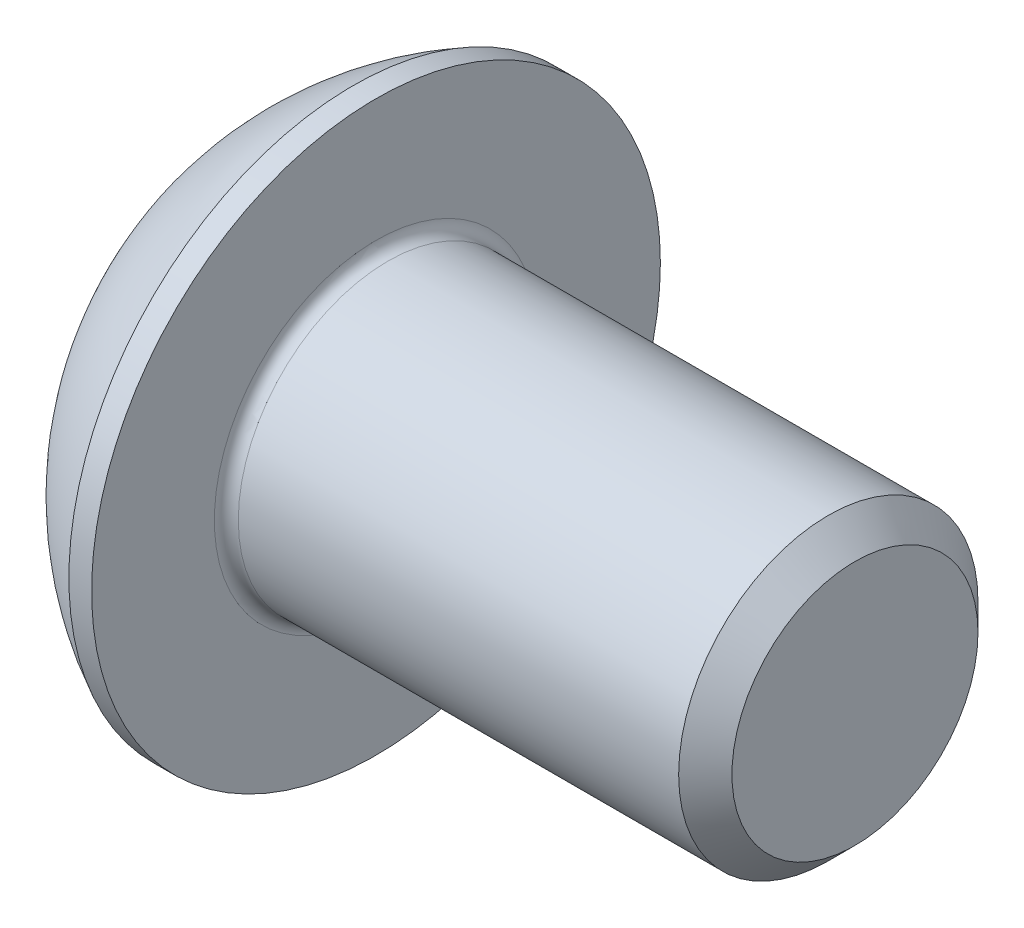
ISO-10303-21;
HEADER;
FILE_DESCRIPTION(('STEP AP214'),'2;1');
FILE_NAME('part.step','',(''),(''),'','','');
FILE_SCHEMA(('AUTOMOTIVE_DESIGN { 1 0 10303 214 1 1 1 1 }'));
ENDSEC;
DATA;
#1=APPLICATION_CONTEXT('core data for automotive mechanical design processes');
#2=APPLICATION_PROTOCOL_DEFINITION('international standard','automotive_design',2000,#1);
#3=PRODUCT_CONTEXT('',#1,'mechanical');
#4=PRODUCT('Part','Part','',(#3));
#5=PRODUCT_RELATED_PRODUCT_CATEGORY('part','',(#4));
#6=PRODUCT_DEFINITION_FORMATION('','',#4);
#7=PRODUCT_DEFINITION_CONTEXT('part definition',#1,'design');
#8=PRODUCT_DEFINITION('design','',#6,#7);
#9=PRODUCT_DEFINITION_SHAPE('','',#8);
#10=(LENGTH_UNIT() NAMED_UNIT(*) SI_UNIT(.MILLI.,.METRE.));
#11=(NAMED_UNIT(*) PLANE_ANGLE_UNIT() SI_UNIT($,.RADIAN.));
#12=(NAMED_UNIT(*) SI_UNIT($,.STERADIAN.) SOLID_ANGLE_UNIT());
#13=UNCERTAINTY_MEASURE_WITH_UNIT(LENGTH_MEASURE(1.E-05),#10,'distance_accuracy_value','');
#14=(GEOMETRIC_REPRESENTATION_CONTEXT(3) GLOBAL_UNCERTAINTY_ASSIGNED_CONTEXT((#13)) GLOBAL_UNIT_ASSIGNED_CONTEXT((#10,
#11,#12)) REPRESENTATION_CONTEXT('',''));
#15=CARTESIAN_POINT('',(0.,0.,0.));
#16=DIRECTION('',(0.,0.,1.));
#17=DIRECTION('',(1.,0.,0.));
#18=AXIS2_PLACEMENT_3D('',#15,#16,#17);
#19=CARTESIAN_POINT('',(4.75485015536775,1.66533453693773E-13,0.));
#20=DIRECTION('',(1.00000000000004,0.,0.));
#21=DIRECTION('',(0.,1.00000000000005,0.));
#22=AXIS2_PLACEMENT_3D('',#19,#20,#21);
#23=SPHERICAL_SURFACE('',#22,5.315);
#24=CARTESIAN_POINT('',(0.,0.,0.));
#25=DIRECTION('',(1.00000000000004,0.,0.));
#26=DIRECTION('',(0.,0.,-0.999999999999988));
#27=AXIS2_PLACEMENT_3D('',#24,#25,#26);
#28=CIRCLE('',#27,2.375);
#29=CARTESIAN_POINT('',(0.,0.,-2.37499999999997));
#30=VERTEX_POINT('',#29);
#31=EDGE_CURVE('E192',#30,#30,#28,.T.);
#32=ORIENTED_EDGE('',*,*,#31,.T.);
#33=EDGE_LOOP('',(#32));
#34=FACE_BOUND('',#33,.T.);
#35=CARTESIAN_POINT('',(2.37016464151057,8.04911692853238E-13,2.9247437804969E-12));
#36=DIRECTION('',(1.00000000000004,0.,0.));
#37=DIRECTION('',(0.,0.,-0.999999999999988));
#38=AXIS2_PLACEMENT_3D('',#35,#36,#37);
#39=CIRCLE('',#38,4.75);
#40=CARTESIAN_POINT('',(2.37016464151058,8.29697421877995E-13,-4.74999999999702));
#41=VERTEX_POINT('',#40);
#42=EDGE_CURVE('E179',#41,#41,#39,.T.);
#43=ORIENTED_EDGE('',*,*,#42,.F.);
#44=EDGE_LOOP('',(#43));
#45=FACE_BOUND('',#44,.T.);
#46=ADVANCED_FACE('F36',(#34,#45),#23,.T.);
#47=CARTESIAN_POINT('',(3.85108611666851E-13,2.37500000000013,5.27355936696949E-13));
#48=DIRECTION('',(-1.00000000000004,0.,0.));
#49=DIRECTION('',(0.,0.,0.999999999999988));
#50=AXIS2_PLACEMENT_3D('',#47,#48,#49);
#51=PLANE('',#50);
#52=DIRECTION('',(0.,0.500000000000031,-0.866025403784429));
#53=VECTOR('',#52,1.);
#54=CARTESIAN_POINT('',(4.9960036108132E-13,0.866025403783777,1.50000000000042));
#55=LINE('',#54,#53);
#56=CARTESIAN_POINT('',(4.9960036108132E-13,0.866025403783777,1.50000000000042));
#57=VERTEX_POINT('',#56);
#58=CARTESIAN_POINT('',(3.38618022510673E-12,1.73205080756881,3.78169717762944E-13));
#59=VERTEX_POINT('',#58);
#60=EDGE_CURVE('E158',#57,#59,#55,.T.);
#61=ORIENTED_EDGE('',*,*,#60,.F.);
#62=DIRECTION('',(0.,1.00000000000005,0.));
#63=VECTOR('',#62,1.);
#64=CARTESIAN_POINT('',(0.,-0.866025403784665,1.50000000000023));
#65=LINE('',#64,#63);
#66=CARTESIAN_POINT('',(0.,-0.866025403784665,1.50000000000023));
#67=VERTEX_POINT('',#66);
#68=EDGE_CURVE('E155',#67,#57,#65,.T.);
#69=ORIENTED_EDGE('',*,*,#68,.F.);
#70=DIRECTION('',(0.,0.500000000000023,0.866025403784426));
#71=VECTOR('',#70,1.);
#72=CARTESIAN_POINT('',(1.07552855510562E-13,-1.73205080756892,0.));
#73=LINE('',#72,#71);
#74=CARTESIAN_POINT('',(1.07552855510562E-13,-1.73205080756892,0.));
#75=VERTEX_POINT('',#74);
#76=EDGE_CURVE('E153',#75,#67,#73,.T.);
#77=ORIENTED_EDGE('',*,*,#76,.F.);
#78=DIRECTION('',(0.,-0.500000000000031,0.866025403784428));
#79=VECTOR('',#78,1.);
#80=CARTESIAN_POINT('',(0.,-0.866025403784762,-1.49999999999993));
#81=LINE('',#80,#79);
#82=CARTESIAN_POINT('',(0.,-0.866025403784762,-1.49999999999993));
#83=VERTEX_POINT('',#82);
#84=EDGE_CURVE('E151',#83,#75,#81,.T.);
#85=ORIENTED_EDGE('',*,*,#84,.F.);
#86=DIRECTION('',(0.,-1.00000000000005,0.));
#87=VECTOR('',#86,1.);
#88=CARTESIAN_POINT('',(2.22044604925031E-12,0.866025403783853,-1.49999999999973));
#89=LINE('',#88,#87);
#90=CARTESIAN_POINT('',(2.22044604925031E-12,0.866025403783853,-1.49999999999973));
#91=VERTEX_POINT('',#90);
#92=EDGE_CURVE('E125',#91,#83,#89,.T.);
#93=ORIENTED_EDGE('',*,*,#92,.F.);
#94=DIRECTION('',(0.,-0.500000000000022,-0.866025403784425));
#95=VECTOR('',#94,1.);
#96=CARTESIAN_POINT('',(3.38618022510673E-12,1.73205080756881,3.78169717762944E-13));
#97=LINE('',#96,#95);
#98=EDGE_CURVE('E118',#59,#91,#97,.T.);
#99=ORIENTED_EDGE('',*,*,#98,.F.);
#100=EDGE_LOOP('',(#61,#69,#77,#85,#93,#99));
#101=FACE_BOUND('',#100,.T.);
#102=ORIENTED_EDGE('',*,*,#31,.F.);
#103=EDGE_LOOP('',(#102));
#104=FACE_BOUND('',#103,.T.);
#105=ADVANCED_FACE('F214',(#101,#104),#51,.T.);
#106=CARTESIAN_POINT('',(10.7500000000038,6.31439345255558E-13,3.0288271890555E-12));
#107=DIRECTION('',(1.00000000000004,0.,0.));
#108=DIRECTION('',(0.,0.,-0.999999999999988));
#109=AXIS2_PLACEMENT_3D('',#106,#107,#108);
#110=PLANE('',#109);
#111=CARTESIAN_POINT('',(10.7500000000038,6.31439345255558E-13,3.0288271890555E-12));
#112=DIRECTION('',(1.00000000000004,0.,0.));
#113=DIRECTION('',(0.,0.,-0.999999999999988));
#114=AXIS2_PLACEMENT_3D('',#111,#112,#113);
#115=CIRCLE('',#114,2.055);
#116=CARTESIAN_POINT('',(10.7500000000038,6.421624343389E-13,-2.05499999999695));
#117=VERTEX_POINT('',#116);
#118=EDGE_CURVE('E189',#117,#117,#115,.T.);
#119=ORIENTED_EDGE('',*,*,#118,.T.);
#120=EDGE_LOOP('',(#119));
#121=FACE_BOUND('',#120,.T.);
#122=ADVANCED_FACE('F219',(#121),#110,.T.);
#123=CARTESIAN_POINT('',(10.7500000000038,6.31439345255558E-13,3.0288271890555E-12));
#124=DIRECTION('',(-1.00000000000004,0.,0.));
#125=DIRECTION('',(0.,0.,0.999999999999988));
#126=AXIS2_PLACEMENT_3D('',#123,#124,#125);
#127=CONICAL_SURFACE('',#126,2.055,0.785398163397435);
#128=CARTESIAN_POINT('',(10.3050000000001,5.20417042793042E-13,2.87270207621759E-12));
#129=DIRECTION('',(1.00000000000004,0.,0.));
#130=DIRECTION('',(0.,0.,-0.999999999999988));
#131=AXIS2_PLACEMENT_3D('',#128,#129,#130);
#132=CIRCLE('',#131,2.5);
#133=CARTESIAN_POINT('',(10.3050000000001,5.33462163332388E-13,-2.4999999999971));
#134=VERTEX_POINT('',#133);
#135=EDGE_CURVE('E186',#134,#134,#132,.T.);
#136=ORIENTED_EDGE('',*,*,#135,.T.);
#137=EDGE_LOOP('',(#136));
#138=FACE_BOUND('',#137,.T.);
#139=ORIENTED_EDGE('',*,*,#118,.F.);
#140=EDGE_LOOP('',(#139));
#141=FACE_BOUND('',#140,.T.);
#142=ADVANCED_FACE('F226',(#138,#141),#127,.T.);
#143=CARTESIAN_POINT('',(-3.64348996551983,0.,5.93275428784068E-13));
#144=DIRECTION('',(1.00000000000004,0.,0.));
#145=DIRECTION('',(0.,0.,-0.999999999999988));
#146=AXIS2_PLACEMENT_3D('',#143,#144,#145);
#147=CYLINDRICAL_SURFACE('',#146,2.5);
#148=CARTESIAN_POINT('',(2.95000000000001,7.35522753814166E-13,3.62557206479152E-12));
#149=DIRECTION('',(1.00000000000004,0.,0.));
#150=DIRECTION('',(0.,0.,-0.999999999999988));
#151=AXIS2_PLACEMENT_3D('',#148,#149,#150);
#152=CIRCLE('',#151,2.5);
#153=CARTESIAN_POINT('',(2.95000000000001,7.48567874353512E-13,-2.49999999999635));
#154=VERTEX_POINT('',#153);
#155=EDGE_CURVE('E44',#154,#154,#152,.T.);
#156=ORIENTED_EDGE('',*,*,#155,.T.);
#157=EDGE_LOOP('',(#156));
#158=FACE_BOUND('',#157,.T.);
#159=ORIENTED_EDGE('',*,*,#135,.F.);
#160=EDGE_LOOP('',(#159));
#161=FACE_BOUND('',#160,.T.);
#162=ADVANCED_FACE('F197',(#158,#161),#147,.T.);
#163=CARTESIAN_POINT('',(2.75000000000047,2.50000000000074,2.58126853225349E-12));
#164=DIRECTION('',(1.00000000000004,0.,0.));
#165=DIRECTION('',(0.,0.,-0.999999999999988));
#166=AXIS2_PLACEMENT_3D('',#163,#164,#165);
#167=PLANE('',#166);
#168=CARTESIAN_POINT('',(2.74999999999997,3.7470027081099E-13,3.25087179398053E-12));
#169=DIRECTION('',(1.00000000000004,0.,0.));
#170=DIRECTION('',(0.,0.,-0.999999999999988));
#171=AXIS2_PLACEMENT_3D('',#168,#169,#170);
#172=CIRCLE('',#171,2.7);
#173=CARTESIAN_POINT('',(2.74999999999998,3.88789000993484E-13,-2.69999999999672));
#174=VERTEX_POINT('',#173);
#175=EDGE_CURVE('E11',#174,#174,#172,.F.);
#176=ORIENTED_EDGE('',*,*,#175,.T.);
#177=EDGE_LOOP('',(#176));
#178=FACE_BOUND('',#177,.T.);
#179=CARTESIAN_POINT('',(2.74999999999997,3.7470027081099E-13,3.25087179398053E-12));
#180=DIRECTION('',(1.00000000000004,0.,0.));
#181=DIRECTION('',(0.,0.,-0.999999999999988));
#182=AXIS2_PLACEMENT_3D('',#179,#180,#181);
#183=CIRCLE('',#182,4.75);
#184=CARTESIAN_POINT('',(2.74999999999998,3.99485999835747E-13,-4.7499999999967));
#185=VERTEX_POINT('',#184);
#186=EDGE_CURVE('E183',#185,#185,#183,.T.);
#187=ORIENTED_EDGE('',*,*,#186,.T.);
#188=EDGE_LOOP('',(#187));
#189=FACE_BOUND('',#188,.T.);
#190=ADVANCED_FACE('F209',(#178,#189),#167,.T.);
#191=CARTESIAN_POINT('',(-3.64348996551983,0.,5.93275428784068E-13));
#192=DIRECTION('',(1.00000000000004,0.,0.));
#193=DIRECTION('',(0.,0.,-0.999999999999988));
#194=AXIS2_PLACEMENT_3D('',#191,#192,#193);
#195=CYLINDRICAL_SURFACE('',#194,4.75);
#196=ORIENTED_EDGE('',*,*,#42,.T.);
#197=EDGE_LOOP('',(#196));
#198=FACE_BOUND('',#197,.T.);
#199=ORIENTED_EDGE('',*,*,#186,.F.);
#200=EDGE_LOOP('',(#199));
#201=FACE_BOUND('',#200,.T.);
#202=ADVANCED_FACE('F201',(#198,#201),#195,.T.);
#203=CARTESIAN_POINT('',(2.95000000000001,7.35522753814166E-13,3.62557206479152E-12));
#204=DIRECTION('',(1.00000000000004,0.,0.));
#205=DIRECTION('',(0.,0.,-0.999999999999988));
#206=AXIS2_PLACEMENT_3D('',#203,#204,#205);
#207=TOROIDAL_SURFACE('',#206,2.7,0.2);
#208=ORIENTED_EDGE('',*,*,#175,.F.);
#209=EDGE_LOOP('',(#208));
#210=FACE_BOUND('',#209,.T.);
#211=ORIENTED_EDGE('',*,*,#155,.F.);
#212=EDGE_LOOP('',(#211));
#213=FACE_BOUND('',#212,.T.);
#214=ADVANCED_FACE('F38',(#210,#213),#207,.F.);
#215=CARTESIAN_POINT('',(1.56000000000223,0.866025403783978,-1.49999999999752));
#216=DIRECTION('',(0.,0.,-0.999999999999988));
#217=DIRECTION('',(-1.00000000000004,0.,0.));
#218=AXIS2_PLACEMENT_3D('',#215,#216,#217);
#219=PLANE('',#218);
#220=DIRECTION('',(0.,-1.00000000000005,0.));
#221=VECTOR('',#220,1.);
#222=CARTESIAN_POINT('',(1.56000000000223,0.866025403783978,-1.49999999999752));
#223=LINE('',#222,#221);
#224=CARTESIAN_POINT('',(1.56000000000223,0.866025403783978,-1.49999999999752));
#225=VERTEX_POINT('',#224);
#226=CARTESIAN_POINT('',(1.56000000000001,-3.88578058618805E-13,-1.49999999999761));
#227=VERTEX_POINT('',#226);
#228=EDGE_CURVE('E117',#225,#227,#223,.T.);
#229=ORIENTED_EDGE('',*,*,#228,.F.);
#230=DIRECTION('',(-1.00000000000004,0.,0.));
#231=VECTOR('',#230,1.);
#232=CARTESIAN_POINT('',(1.56000000000223,0.866025403783978,-1.49999999999752));
#233=LINE('',#232,#231);
#234=EDGE_CURVE('E163',#225,#91,#233,.T.);
#235=ORIENTED_EDGE('',*,*,#234,.T.);
#236=ORIENTED_EDGE('',*,*,#92,.T.);
#237=DIRECTION('',(-1.00000000000004,0.,0.));
#238=VECTOR('',#237,1.);
#239=CARTESIAN_POINT('',(1.56,-0.866025403784665,-1.499999999997));
#240=LINE('',#239,#238);
#241=CARTESIAN_POINT('',(1.56,-0.866025403784665,-1.499999999997));
#242=VERTEX_POINT('',#241);
#243=EDGE_CURVE('E122',#242,#83,#240,.T.);
#244=ORIENTED_EDGE('',*,*,#243,.F.);
#245=EDGE_CURVE('E107',#227,#242,#223,.T.);
#246=ORIENTED_EDGE('',*,*,#245,.F.);
#247=EDGE_LOOP('',(#229,#235,#236,#244,#246));
#248=FACE_BOUND('',#247,.T.);
#249=ADVANCED_FACE('F123',(#248),#219,.F.);
#250=CARTESIAN_POINT('',(1.56000000000339,1.73205080756919,2.7373936450914E-12));
#251=DIRECTION('',(0.,0.866025403784494,-0.499999999999999));
#252=DIRECTION('',(0.,0.500000000000021,0.866025403784426));
#253=AXIS2_PLACEMENT_3D('',#250,#251,#252);
#254=PLANE('',#253);
#255=DIRECTION('',(0.,-0.500000000000022,-0.866025403784425));
#256=VECTOR('',#255,1.);
#257=CARTESIAN_POINT('',(1.56000000000339,1.73205080756919,2.7373936450914E-12));
#258=LINE('',#257,#256);
#259=CARTESIAN_POINT('',(1.56000000000339,1.73205080756919,2.7373936450914E-12));
#260=VERTEX_POINT('',#259);
#261=CARTESIAN_POINT('',(1.55999999999984,1.29903810567677,-0.749999999997152));
#262=VERTEX_POINT('',#261);
#263=EDGE_CURVE('E129',#260,#262,#258,.T.);
#264=ORIENTED_EDGE('',*,*,#263,.F.);
#265=DIRECTION('',(-1.00000000000004,0.,0.));
#266=VECTOR('',#265,1.);
#267=CARTESIAN_POINT('',(1.56000000000339,1.73205080756919,2.7373936450914E-12));
#268=LINE('',#267,#266);
#269=EDGE_CURVE('E166',#260,#59,#268,.T.);
#270=ORIENTED_EDGE('',*,*,#269,.T.);
#271=ORIENTED_EDGE('',*,*,#98,.T.);
#272=ORIENTED_EDGE('',*,*,#234,.F.);
#273=EDGE_CURVE('E147',#262,#225,#258,.T.);
#274=ORIENTED_EDGE('',*,*,#273,.F.);
#275=EDGE_LOOP('',(#264,#270,#271,#272,#274));
#276=FACE_BOUND('',#275,.T.);
#277=ADVANCED_FACE('F207',(#276),#254,.F.);
#278=CARTESIAN_POINT('',(1.56000000000051,0.866025403784325,1.5000000000024));
#279=DIRECTION('',(0.,0.866025403784488,0.499999999999989));
#280=DIRECTION('',(0.,-0.500000000000031,0.866025403784429));
#281=AXIS2_PLACEMENT_3D('',#278,#279,#280);
#282=PLANE('',#281);
#283=DIRECTION('',(0.,0.500000000000031,-0.866025403784429));
#284=VECTOR('',#283,1.);
#285=CARTESIAN_POINT('',(1.56000000000051,0.866025403784325,1.5000000000024));
#286=LINE('',#285,#284);
#287=CARTESIAN_POINT('',(1.56000000000051,0.866025403784325,1.5000000000024));
#288=VERTEX_POINT('',#287);
#289=CARTESIAN_POINT('',(1.56000000000039,1.29903810567634,0.750000000002765));
#290=VERTEX_POINT('',#289);
#291=EDGE_CURVE('E51',#288,#290,#286,.T.);
#292=ORIENTED_EDGE('',*,*,#291,.F.);
#293=DIRECTION('',(-1.00000000000004,0.,0.));
#294=VECTOR('',#293,1.);
#295=CARTESIAN_POINT('',(1.56000000000051,0.866025403784325,1.5000000000024));
#296=LINE('',#295,#294);
#297=EDGE_CURVE('E169',#288,#57,#296,.T.);
#298=ORIENTED_EDGE('',*,*,#297,.T.);
#299=ORIENTED_EDGE('',*,*,#60,.T.);
#300=ORIENTED_EDGE('',*,*,#269,.F.);
#301=EDGE_CURVE('E145',#290,#260,#286,.T.);
#302=ORIENTED_EDGE('',*,*,#301,.F.);
#303=EDGE_LOOP('',(#292,#298,#299,#300,#302));
#304=FACE_BOUND('',#303,.T.);
#305=ADVANCED_FACE('F251',(#304),#282,.F.);
#306=CARTESIAN_POINT('',(1.56000000000006,-0.866025403784491,1.50000000000304));
#307=DIRECTION('',(0.,0.,0.999999999999984));
#308=DIRECTION('',(0.,-1.00000000000005,0.));
#309=AXIS2_PLACEMENT_3D('',#306,#307,#308);
#310=PLANE('',#309);
#311=DIRECTION('',(0.,1.00000000000005,0.));
#312=VECTOR('',#311,1.);
#313=CARTESIAN_POINT('',(1.56000000000006,-0.866025403784491,1.50000000000304));
#314=LINE('',#313,#312);
#315=CARTESIAN_POINT('',(1.56000000000006,-0.866025403784491,1.50000000000304));
#316=VERTEX_POINT('',#315);
#317=CARTESIAN_POINT('',(1.56000000000178,-2.56739074444567E-13,1.50000000000236));
#318=VERTEX_POINT('',#317);
#319=EDGE_CURVE('E142',#316,#318,#314,.T.);
#320=ORIENTED_EDGE('',*,*,#319,.F.);
#321=DIRECTION('',(-1.00000000000004,0.,0.));
#322=VECTOR('',#321,1.);
#323=CARTESIAN_POINT('',(1.56000000000006,-0.866025403784491,1.50000000000304));
#324=LINE('',#323,#322);
#325=EDGE_CURVE('E172',#316,#67,#324,.T.);
#326=ORIENTED_EDGE('',*,*,#325,.T.);
#327=ORIENTED_EDGE('',*,*,#68,.T.);
#328=ORIENTED_EDGE('',*,*,#297,.F.);
#329=EDGE_CURVE('E141',#318,#288,#314,.T.);
#330=ORIENTED_EDGE('',*,*,#329,.F.);
#331=EDGE_LOOP('',(#320,#326,#327,#328,#330));
#332=FACE_BOUND('',#331,.T.);
#333=ADVANCED_FACE('F247',(#332),#310,.F.);
#334=CARTESIAN_POINT('',(1.56000000000011,-1.73205080756877,8.29197821516913E-13));
#335=DIRECTION('',(0.,-0.866025403784495,0.499999999999999));
#336=DIRECTION('',(0.,-0.500000000000022,-0.866025403784426));
#337=AXIS2_PLACEMENT_3D('',#334,#335,#336);
#338=PLANE('',#337);
#339=DIRECTION('',(0.,0.500000000000023,0.866025403784426));
#340=VECTOR('',#339,1.);
#341=CARTESIAN_POINT('',(1.56000000000011,-1.73205080756877,8.29197821516913E-13));
#342=LINE('',#341,#340);
#343=CARTESIAN_POINT('',(1.56000000000011,-1.73205080756877,8.29197821516913E-13));
#344=VERTEX_POINT('',#343);
#345=CARTESIAN_POINT('',(1.56000000000233,-1.29903810567714,0.750000000002238));
#346=VERTEX_POINT('',#345);
#347=EDGE_CURVE('E137',#344,#346,#342,.T.);
#348=ORIENTED_EDGE('',*,*,#347,.F.);
#349=DIRECTION('',(-1.00000000000004,0.,0.));
#350=VECTOR('',#349,1.);
#351=CARTESIAN_POINT('',(1.56000000000011,-1.73205080756877,8.29197821516913E-13));
#352=LINE('',#351,#350);
#353=EDGE_CURVE('E128',#344,#75,#352,.T.);
#354=ORIENTED_EDGE('',*,*,#353,.T.);
#355=ORIENTED_EDGE('',*,*,#76,.T.);
#356=ORIENTED_EDGE('',*,*,#325,.F.);
#357=EDGE_CURVE('E135',#346,#316,#342,.T.);
#358=ORIENTED_EDGE('',*,*,#357,.F.);
#359=EDGE_LOOP('',(#348,#354,#355,#356,#358));
#360=FACE_BOUND('',#359,.T.);
#361=ADVANCED_FACE('F244',(#360),#338,.F.);
#362=CARTESIAN_POINT('',(1.56,-0.866025403784665,-1.499999999997));
#363=DIRECTION('',(0.,-0.86602540378449,-0.499999999999989));
#364=DIRECTION('',(0.,0.50000000000003,-0.866025403784429));
#365=AXIS2_PLACEMENT_3D('',#362,#363,#364);
#366=PLANE('',#365);
#367=DIRECTION('',(0.,-0.500000000000031,0.866025403784428));
#368=VECTOR('',#367,1.);
#369=CARTESIAN_POINT('',(1.56,-0.866025403784665,-1.499999999997));
#370=LINE('',#369,#368);
#371=CARTESIAN_POINT('',(1.56000000000233,-1.29903810567728,-0.749999999997592));
#372=VERTEX_POINT('',#371);
#373=EDGE_CURVE('E111',#242,#372,#370,.T.);
#374=ORIENTED_EDGE('',*,*,#373,.F.);
#375=ORIENTED_EDGE('',*,*,#243,.T.);
#376=ORIENTED_EDGE('',*,*,#84,.T.);
#377=ORIENTED_EDGE('',*,*,#353,.F.);
#378=EDGE_CURVE('E134',#372,#344,#370,.T.);
#379=ORIENTED_EDGE('',*,*,#378,.F.);
#380=EDGE_LOOP('',(#374,#375,#376,#377,#379));
#381=FACE_BOUND('',#380,.T.);
#382=ADVANCED_FACE('F132',(#381),#366,.F.);
#383=CARTESIAN_POINT('',(1.56000000000001,5.82867087928207E-13,2.40779618465581E-12));
#384=DIRECTION('',(-1.00000000000004,0.,0.));
#385=DIRECTION('',(0.,0.,0.999999999999988));
#386=AXIS2_PLACEMENT_3D('',#383,#384,#385);
#387=PLANE('',#386);
#388=CARTESIAN_POINT('',(1.56000000000001,5.82867087928207E-13,2.40779618465581E-12));
#389=DIRECTION('',(1.00000000000004,0.,0.));
#390=DIRECTION('',(0.,1.00000000000005,0.));
#391=AXIS2_PLACEMENT_3D('',#388,#389,#390);
#392=CIRCLE('',#391,1.5);
#393=EDGE_CURVE('E180',#318,#346,#392,.T.);
#394=ORIENTED_EDGE('',*,*,#393,.T.);
#395=ORIENTED_EDGE('',*,*,#357,.T.);
#396=ORIENTED_EDGE('',*,*,#319,.T.);
#397=EDGE_LOOP('',(#394,#395,#396));
#398=FACE_BOUND('',#397,.T.);
#399=ADVANCED_FACE('F243',(#398),#387,.T.);
#400=EDGE_CURVE('E282',#346,#372,#392,.T.);
#401=ORIENTED_EDGE('',*,*,#400,.T.);
#402=ORIENTED_EDGE('',*,*,#378,.T.);
#403=ORIENTED_EDGE('',*,*,#347,.T.);
#404=EDGE_LOOP('',(#401,#402,#403));
#405=FACE_BOUND('',#404,.T.);
#406=ADVANCED_FACE('F260',(#405),#387,.T.);
#407=EDGE_CURVE('E113',#372,#227,#392,.T.);
#408=ORIENTED_EDGE('',*,*,#407,.T.);
#409=ORIENTED_EDGE('',*,*,#245,.T.);
#410=ORIENTED_EDGE('',*,*,#373,.T.);
#411=EDGE_LOOP('',(#408,#409,#410));
#412=FACE_BOUND('',#411,.T.);
#413=ADVANCED_FACE('F109',(#412),#387,.T.);
#414=EDGE_CURVE('E283',#227,#262,#392,.T.);
#415=ORIENTED_EDGE('',*,*,#414,.T.);
#416=ORIENTED_EDGE('',*,*,#273,.T.);
#417=ORIENTED_EDGE('',*,*,#228,.T.);
#418=EDGE_LOOP('',(#415,#416,#417));
#419=FACE_BOUND('',#418,.T.);
#420=ADVANCED_FACE('F271',(#419),#387,.T.);
#421=EDGE_CURVE('E165',#262,#290,#392,.T.);
#422=ORIENTED_EDGE('',*,*,#421,.T.);
#423=ORIENTED_EDGE('',*,*,#301,.T.);
#424=ORIENTED_EDGE('',*,*,#263,.T.);
#425=EDGE_LOOP('',(#422,#423,#424));
#426=FACE_BOUND('',#425,.T.);
#427=ADVANCED_FACE('F267',(#426),#387,.T.);
#428=EDGE_CURVE('E177',#290,#318,#392,.T.);
#429=ORIENTED_EDGE('',*,*,#428,.T.);
#430=ORIENTED_EDGE('',*,*,#329,.T.);
#431=ORIENTED_EDGE('',*,*,#291,.T.);
#432=EDGE_LOOP('',(#429,#430,#431));
#433=FACE_BOUND('',#432,.T.);
#434=ADVANCED_FACE('F238',(#433),#387,.T.);
#435=CARTESIAN_POINT('',(2.42602540378445,9.85322934354826E-13,3.07739944638285E-12));
#436=DIRECTION('',(-1.00000000000004,0.,0.));
#437=DIRECTION('',(0.,-1.00000000000005,0.));
#438=AXIS2_PLACEMENT_3D('',#435,#436,#437);
#439=CONICAL_SURFACE('',#438,0.,1.04719755119659);
#440=ORIENTED_EDGE('',*,*,#428,.F.);
#441=ORIENTED_EDGE('',*,*,#421,.F.);
#442=ORIENTED_EDGE('',*,*,#414,.F.);
#443=ORIENTED_EDGE('',*,*,#407,.F.);
#444=ORIENTED_EDGE('',*,*,#400,.F.);
#445=ORIENTED_EDGE('',*,*,#393,.F.);
#446=EDGE_LOOP('',(#440,#441,#442,#443,#444,#445));
#447=FACE_BOUND('',#446,.T.);
#448=CARTESIAN_POINT('',(2.42602540378445,9.85322934354826E-13,3.07739944638285E-12));
#449=VERTEX_POINT('',#448);
#450=VERTEX_LOOP('',#449);
#451=FACE_BOUND('',#450,.T.);
#452=ADVANCED_FACE('F236',(#447,#451),#439,.F.);
#453=CLOSED_SHELL('',(#46,#105,#122,#142,#162,#190,#202,#214,#249,#277,#305,#333,#361,#382,#399,
#406,#413,#420,#427,#434,#452));
#454=MANIFOLD_SOLID_BREP('B2',#453);
#455=ADVANCED_BREP_SHAPE_REPRESENTATION('',(#18,#454),#14);
#456=SHAPE_DEFINITION_REPRESENTATION(#9,#455);
ENDSEC;
END-ISO-10303-21;
